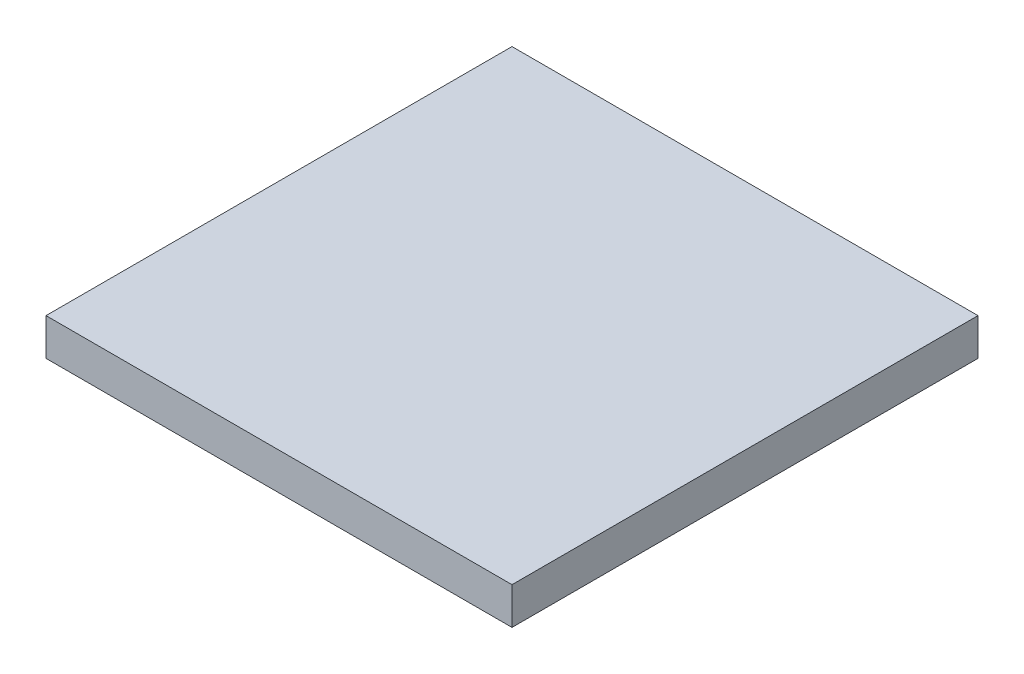
ISO-10303-21;
HEADER;
FILE_DESCRIPTION(('STEP AP214'),'2;1');
FILE_NAME('part.step','',(''),(''),'','','');
FILE_SCHEMA(('AUTOMOTIVE_DESIGN { 1 0 10303 214 1 1 1 1 }'));
ENDSEC;
DATA;
#1=APPLICATION_CONTEXT('core data for automotive mechanical design processes');
#2=APPLICATION_PROTOCOL_DEFINITION('international standard','automotive_design',2000,#1);
#3=PRODUCT_CONTEXT('',#1,'mechanical');
#4=PRODUCT('Part','Part','',(#3));
#5=PRODUCT_RELATED_PRODUCT_CATEGORY('part','',(#4));
#6=PRODUCT_DEFINITION_FORMATION('','',#4);
#7=PRODUCT_DEFINITION_CONTEXT('part definition',#1,'design');
#8=PRODUCT_DEFINITION('design','',#6,#7);
#9=PRODUCT_DEFINITION_SHAPE('','',#8);
#10=(LENGTH_UNIT() NAMED_UNIT(*) SI_UNIT(.MILLI.,.METRE.));
#11=(NAMED_UNIT(*) PLANE_ANGLE_UNIT() SI_UNIT($,.RADIAN.));
#12=(NAMED_UNIT(*) SI_UNIT($,.STERADIAN.) SOLID_ANGLE_UNIT());
#13=UNCERTAINTY_MEASURE_WITH_UNIT(LENGTH_MEASURE(1.E-05),#10,'distance_accuracy_value','');
#14=(GEOMETRIC_REPRESENTATION_CONTEXT(3) GLOBAL_UNCERTAINTY_ASSIGNED_CONTEXT((#13)) GLOBAL_UNIT_ASSIGNED_CONTEXT((#10,
#11,#12)) REPRESENTATION_CONTEXT('',''));
#15=CARTESIAN_POINT('',(0.,0.,0.));
#16=DIRECTION('',(0.,0.,1.));
#17=DIRECTION('',(1.,0.,0.));
#18=AXIS2_PLACEMENT_3D('',#15,#16,#17);
#19=CARTESIAN_POINT('',(0.,1.59,0.));
#20=DIRECTION('',(1.,0.,0.));
#21=DIRECTION('',(0.,0.,-1.));
#22=AXIS2_PLACEMENT_3D('',#19,#20,#21);
#23=PLANE('',#22);
#24=DIRECTION('',(0.,0.,1.));
#25=VECTOR('',#24,1.);
#26=CARTESIAN_POINT('',(0.,0.,0.));
#27=LINE('',#26,#25);
#28=CARTESIAN_POINT('',(0.,0.,-20.));
#29=VERTEX_POINT('',#28);
#30=CARTESIAN_POINT('',(0.,0.,0.));
#31=VERTEX_POINT('',#30);
#32=EDGE_CURVE('E106',#29,#31,#27,.T.);
#33=ORIENTED_EDGE('',*,*,#32,.T.);
#34=DIRECTION('',(0.,-1.,0.));
#35=VECTOR('',#34,1.);
#36=CARTESIAN_POINT('',(0.,1.59,0.));
#37=LINE('',#36,#35);
#38=CARTESIAN_POINT('',(0.,1.59,0.));
#39=VERTEX_POINT('',#38);
#40=EDGE_CURVE('E11',#39,#31,#37,.T.);
#41=ORIENTED_EDGE('',*,*,#40,.F.);
#42=DIRECTION('',(0.,0.,1.));
#43=VECTOR('',#42,1.);
#44=CARTESIAN_POINT('',(0.,1.59,0.));
#45=LINE('',#44,#43);
#46=CARTESIAN_POINT('',(0.,1.59,-20.));
#47=VERTEX_POINT('',#46);
#48=EDGE_CURVE('E94',#47,#39,#45,.T.);
#49=ORIENTED_EDGE('',*,*,#48,.F.);
#50=DIRECTION('',(0.,-1.,0.));
#51=VECTOR('',#50,1.);
#52=CARTESIAN_POINT('',(0.,1.59,-20.));
#53=LINE('',#52,#51);
#54=EDGE_CURVE('E102',#47,#29,#53,.T.);
#55=ORIENTED_EDGE('',*,*,#54,.T.);
#56=EDGE_LOOP('',(#33,#41,#49,#55));
#57=FACE_BOUND('',#56,.T.);
#58=ADVANCED_FACE('F43',(#57),#23,.F.);
#59=CARTESIAN_POINT('',(0.,1.59,0.));
#60=DIRECTION('',(0.,0.,-1.));
#61=DIRECTION('',(-1.,0.,0.));
#62=AXIS2_PLACEMENT_3D('',#59,#60,#61);
#63=PLANE('',#62);
#64=DIRECTION('',(1.,0.,0.));
#65=VECTOR('',#64,1.);
#66=CARTESIAN_POINT('',(0.,0.,0.));
#67=LINE('',#66,#65);
#68=CARTESIAN_POINT('',(20.,0.,0.));
#69=VERTEX_POINT('',#68);
#70=EDGE_CURVE('E98',#31,#69,#67,.T.);
#71=ORIENTED_EDGE('',*,*,#70,.T.);
#72=DIRECTION('',(0.,-1.,0.));
#73=VECTOR('',#72,1.);
#74=CARTESIAN_POINT('',(20.,1.59,0.));
#75=LINE('',#74,#73);
#76=CARTESIAN_POINT('',(20.,1.59,0.));
#77=VERTEX_POINT('',#76);
#78=EDGE_CURVE('E51',#77,#69,#75,.T.);
#79=ORIENTED_EDGE('',*,*,#78,.F.);
#80=DIRECTION('',(1.,0.,0.));
#81=VECTOR('',#80,1.);
#82=CARTESIAN_POINT('',(0.,1.59,0.));
#83=LINE('',#82,#81);
#84=EDGE_CURVE('E89',#39,#77,#83,.T.);
#85=ORIENTED_EDGE('',*,*,#84,.F.);
#86=ORIENTED_EDGE('',*,*,#40,.T.);
#87=EDGE_LOOP('',(#71,#79,#85,#86));
#88=FACE_BOUND('',#87,.T.);
#89=ADVANCED_FACE('F97',(#88),#63,.F.);
#90=CARTESIAN_POINT('',(20.,1.59,0.));
#91=DIRECTION('',(-1.,0.,0.));
#92=DIRECTION('',(0.,0.,1.));
#93=AXIS2_PLACEMENT_3D('',#90,#91,#92);
#94=PLANE('',#93);
#95=DIRECTION('',(0.,0.,-1.));
#96=VECTOR('',#95,1.);
#97=CARTESIAN_POINT('',(20.,0.,0.));
#98=LINE('',#97,#96);
#99=CARTESIAN_POINT('',(20.,0.,-20.));
#100=VERTEX_POINT('',#99);
#101=EDGE_CURVE('E76',#69,#100,#98,.T.);
#102=ORIENTED_EDGE('',*,*,#101,.T.);
#103=DIRECTION('',(0.,-1.,0.));
#104=VECTOR('',#103,1.);
#105=CARTESIAN_POINT('',(20.,1.59,-20.));
#106=LINE('',#105,#104);
#107=CARTESIAN_POINT('',(20.,1.59,-20.));
#108=VERTEX_POINT('',#107);
#109=EDGE_CURVE('E99',#108,#100,#106,.T.);
#110=ORIENTED_EDGE('',*,*,#109,.F.);
#111=DIRECTION('',(0.,0.,-1.));
#112=VECTOR('',#111,1.);
#113=CARTESIAN_POINT('',(20.,1.59,0.));
#114=LINE('',#113,#112);
#115=EDGE_CURVE('E92',#77,#108,#114,.T.);
#116=ORIENTED_EDGE('',*,*,#115,.F.);
#117=ORIENTED_EDGE('',*,*,#78,.T.);
#118=EDGE_LOOP('',(#102,#110,#116,#117));
#119=FACE_BOUND('',#118,.T.);
#120=ADVANCED_FACE('F100',(#119),#94,.F.);
#121=CARTESIAN_POINT('',(0.,1.59,-20.));
#122=DIRECTION('',(0.,0.,1.));
#123=DIRECTION('',(1.,0.,0.));
#124=AXIS2_PLACEMENT_3D('',#121,#122,#123);
#125=PLANE('',#124);
#126=DIRECTION('',(-1.,0.,0.));
#127=VECTOR('',#126,1.);
#128=CARTESIAN_POINT('',(0.,0.,-20.));
#129=LINE('',#128,#127);
#130=EDGE_CURVE('E82',#100,#29,#129,.T.);
#131=ORIENTED_EDGE('',*,*,#130,.T.);
#132=ORIENTED_EDGE('',*,*,#54,.F.);
#133=DIRECTION('',(-1.,0.,0.));
#134=VECTOR('',#133,1.);
#135=CARTESIAN_POINT('',(0.,1.59,-20.));
#136=LINE('',#135,#134);
#137=EDGE_CURVE('E59',#108,#47,#136,.T.);
#138=ORIENTED_EDGE('',*,*,#137,.F.);
#139=ORIENTED_EDGE('',*,*,#109,.T.);
#140=EDGE_LOOP('',(#131,#132,#138,#139));
#141=FACE_BOUND('',#140,.T.);
#142=ADVANCED_FACE('F113',(#141),#125,.F.);
#143=CARTESIAN_POINT('',(0.,1.59,0.));
#144=DIRECTION('',(0.,-1.,0.));
#145=DIRECTION('',(0.,0.,-1.));
#146=AXIS2_PLACEMENT_3D('',#143,#144,#145);
#147=PLANE('',#146);
#148=ORIENTED_EDGE('',*,*,#48,.T.);
#149=ORIENTED_EDGE('',*,*,#84,.T.);
#150=ORIENTED_EDGE('',*,*,#115,.T.);
#151=ORIENTED_EDGE('',*,*,#137,.T.);
#152=EDGE_LOOP('',(#148,#149,#150,#151));
#153=FACE_BOUND('',#152,.T.);
#154=ADVANCED_FACE('F90',(#153),#147,.F.);
#155=CARTESIAN_POINT('',(0.,0.,0.));
#156=DIRECTION('',(0.,-1.,0.));
#157=DIRECTION('',(0.,0.,-1.));
#158=AXIS2_PLACEMENT_3D('',#155,#156,#157);
#159=PLANE('',#158);
#160=ORIENTED_EDGE('',*,*,#32,.F.);
#161=ORIENTED_EDGE('',*,*,#130,.F.);
#162=ORIENTED_EDGE('',*,*,#101,.F.);
#163=ORIENTED_EDGE('',*,*,#70,.F.);
#164=EDGE_LOOP('',(#160,#161,#162,#163));
#165=FACE_BOUND('',#164,.T.);
#166=ADVANCED_FACE('F116',(#165),#159,.T.);
#167=CLOSED_SHELL('',(#58,#89,#120,#142,#154,#166));
#168=MANIFOLD_SOLID_BREP('B2',#167);
#169=ADVANCED_BREP_SHAPE_REPRESENTATION('',(#18,#168),#14);
#170=SHAPE_DEFINITION_REPRESENTATION(#9,#169);
ENDSEC;
END-ISO-10303-21;
